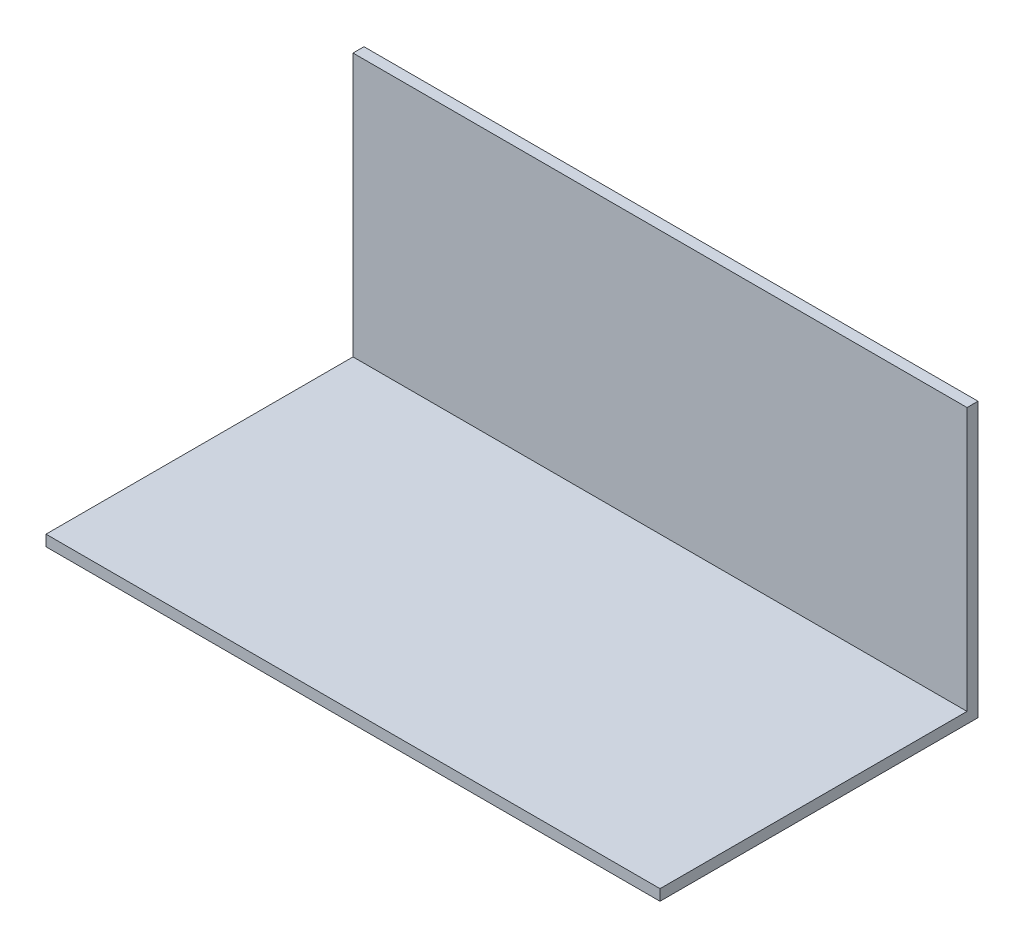
ISO-10303-21;
HEADER;
FILE_DESCRIPTION(('STEP AP214'),'2;1');
FILE_NAME('part.step','',(''),(''),'','','');
FILE_SCHEMA(('AUTOMOTIVE_DESIGN { 1 0 10303 214 1 1 1 1 }'));
ENDSEC;
DATA;
#1=APPLICATION_CONTEXT('core data for automotive mechanical design processes');
#2=APPLICATION_PROTOCOL_DEFINITION('international standard','automotive_design',2000,#1);
#3=PRODUCT_CONTEXT('',#1,'mechanical');
#4=PRODUCT('Part','Part','',(#3));
#5=PRODUCT_RELATED_PRODUCT_CATEGORY('part','',(#4));
#6=PRODUCT_DEFINITION_FORMATION('','',#4);
#7=PRODUCT_DEFINITION_CONTEXT('part definition',#1,'design');
#8=PRODUCT_DEFINITION('design','',#6,#7);
#9=PRODUCT_DEFINITION_SHAPE('','',#8);
#10=(LENGTH_UNIT() NAMED_UNIT(*) SI_UNIT(.MILLI.,.METRE.));
#11=(NAMED_UNIT(*) PLANE_ANGLE_UNIT() SI_UNIT($,.RADIAN.));
#12=(NAMED_UNIT(*) SI_UNIT($,.STERADIAN.) SOLID_ANGLE_UNIT());
#13=UNCERTAINTY_MEASURE_WITH_UNIT(LENGTH_MEASURE(1.E-05),#10,'distance_accuracy_value','');
#14=(GEOMETRIC_REPRESENTATION_CONTEXT(3) GLOBAL_UNCERTAINTY_ASSIGNED_CONTEXT((#13)) GLOBAL_UNIT_ASSIGNED_CONTEXT((#10,
#11,#12)) REPRESENTATION_CONTEXT('',''));
#15=CARTESIAN_POINT('',(0.,0.,0.));
#16=DIRECTION('',(0.,0.,1.));
#17=DIRECTION('',(1.,0.,0.));
#18=AXIS2_PLACEMENT_3D('',#15,#16,#17);
#19=CARTESIAN_POINT('',(0.,6.35,0.));
#20=DIRECTION('',(0.,-1.,0.));
#21=DIRECTION('',(0.,0.,-1.));
#22=AXIS2_PLACEMENT_3D('',#19,#20,#21);
#23=PLANE('',#22);
#24=DIRECTION('',(1.,0.,0.));
#25=VECTOR('',#24,1.);
#26=CARTESIAN_POINT('',(0.,6.35,-177.8));
#27=LINE('',#26,#25);
#28=CARTESIAN_POINT('',(0.,6.35,-177.8));
#29=VERTEX_POINT('',#28);
#30=CARTESIAN_POINT('',(355.6,6.35,-177.8));
#31=VERTEX_POINT('',#30);
#32=EDGE_CURVE('E50',#29,#31,#27,.T.);
#33=ORIENTED_EDGE('',*,*,#32,.F.);
#34=DIRECTION('',(0.,0.,1.));
#35=VECTOR('',#34,1.);
#36=CARTESIAN_POINT('',(0.,6.35,0.));
#37=LINE('',#36,#35);
#38=CARTESIAN_POINT('',(0.,6.35,0.));
#39=VERTEX_POINT('',#38);
#40=EDGE_CURVE('E87',#29,#39,#37,.T.);
#41=ORIENTED_EDGE('',*,*,#40,.T.);
#42=DIRECTION('',(1.,0.,0.));
#43=VECTOR('',#42,1.);
#44=CARTESIAN_POINT('',(0.,6.35,0.));
#45=LINE('',#44,#43);
#46=CARTESIAN_POINT('',(355.6,6.35,0.));
#47=VERTEX_POINT('',#46);
#48=EDGE_CURVE('E56',#39,#47,#45,.T.);
#49=ORIENTED_EDGE('',*,*,#48,.T.);
#50=DIRECTION('',(0.,0.,-1.));
#51=VECTOR('',#50,1.);
#52=CARTESIAN_POINT('',(355.6,6.35,0.));
#53=LINE('',#52,#51);
#54=EDGE_CURVE('E98',#47,#31,#53,.T.);
#55=ORIENTED_EDGE('',*,*,#54,.T.);
#56=EDGE_LOOP('',(#33,#41,#49,#55));
#57=FACE_BOUND('',#56,.T.);
#58=ADVANCED_FACE('F33',(#57),#23,.F.);
#59=CARTESIAN_POINT('',(0.,6.35,0.));
#60=DIRECTION('',(1.,0.,0.));
#61=DIRECTION('',(0.,0.,-1.));
#62=AXIS2_PLACEMENT_3D('',#59,#60,#61);
#63=PLANE('',#62);
#64=DIRECTION('',(0.,0.,1.));
#65=VECTOR('',#64,1.);
#66=CARTESIAN_POINT('',(0.,0.,0.));
#67=LINE('',#66,#65);
#68=CARTESIAN_POINT('',(0.,0.,-184.15));
#69=VERTEX_POINT('',#68);
#70=CARTESIAN_POINT('',(0.,0.,0.));
#71=VERTEX_POINT('',#70);
#72=EDGE_CURVE('E94',#69,#71,#67,.T.);
#73=ORIENTED_EDGE('',*,*,#72,.T.);
#74=DIRECTION('',(0.,-1.,0.));
#75=VECTOR('',#74,1.);
#76=CARTESIAN_POINT('',(0.,6.35,0.));
#77=LINE('',#76,#75);
#78=EDGE_CURVE('E11',#39,#71,#77,.T.);
#79=ORIENTED_EDGE('',*,*,#78,.F.);
#80=ORIENTED_EDGE('',*,*,#40,.F.);
#81=DIRECTION('',(0.,-1.,0.));
#82=VECTOR('',#81,1.);
#83=CARTESIAN_POINT('',(0.,158.75,-177.8));
#84=LINE('',#83,#82);
#85=CARTESIAN_POINT('',(0.,158.75,-177.8));
#86=VERTEX_POINT('',#85);
#87=EDGE_CURVE('E102',#86,#29,#84,.T.);
#88=ORIENTED_EDGE('',*,*,#87,.F.);
#89=DIRECTION('',(0.,0.,1.));
#90=VECTOR('',#89,1.);
#91=CARTESIAN_POINT('',(0.,158.75,-177.8));
#92=LINE('',#91,#90);
#93=CARTESIAN_POINT('',(0.,158.75,-184.15));
#94=VERTEX_POINT('',#93);
#95=EDGE_CURVE('E97',#94,#86,#92,.T.);
#96=ORIENTED_EDGE('',*,*,#95,.F.);
#97=DIRECTION('',(0.,-1.,0.));
#98=VECTOR('',#97,1.);
#99=CARTESIAN_POINT('',(0.,6.35,-184.15));
#100=LINE('',#99,#98);
#101=EDGE_CURVE('E80',#94,#69,#100,.T.);
#102=ORIENTED_EDGE('',*,*,#101,.T.);
#103=EDGE_LOOP('',(#73,#79,#80,#88,#96,#102));
#104=FACE_BOUND('',#103,.T.);
#105=ADVANCED_FACE('F35',(#104),#63,.F.);
#106=CARTESIAN_POINT('',(0.,6.35,0.));
#107=DIRECTION('',(0.,0.,-1.));
#108=DIRECTION('',(-1.,0.,0.));
#109=AXIS2_PLACEMENT_3D('',#106,#107,#108);
#110=PLANE('',#109);
#111=DIRECTION('',(1.,0.,0.));
#112=VECTOR('',#111,1.);
#113=CARTESIAN_POINT('',(0.,0.,0.));
#114=LINE('',#113,#112);
#115=CARTESIAN_POINT('',(355.6,0.,0.));
#116=VERTEX_POINT('',#115);
#117=EDGE_CURVE('E101',#71,#116,#114,.T.);
#118=ORIENTED_EDGE('',*,*,#117,.T.);
#119=DIRECTION('',(0.,-1.,0.));
#120=VECTOR('',#119,1.);
#121=CARTESIAN_POINT('',(355.6,6.35,0.));
#122=LINE('',#121,#120);
#123=EDGE_CURVE('E42',#47,#116,#122,.T.);
#124=ORIENTED_EDGE('',*,*,#123,.F.);
#125=ORIENTED_EDGE('',*,*,#48,.F.);
#126=ORIENTED_EDGE('',*,*,#78,.T.);
#127=EDGE_LOOP('',(#118,#124,#125,#126));
#128=FACE_BOUND('',#127,.T.);
#129=ADVANCED_FACE('F149',(#128),#110,.F.);
#130=CARTESIAN_POINT('',(355.6,6.35,0.));
#131=DIRECTION('',(-1.,0.,0.));
#132=DIRECTION('',(0.,0.,1.));
#133=AXIS2_PLACEMENT_3D('',#130,#131,#132);
#134=PLANE('',#133);
#135=DIRECTION('',(0.,0.,-1.));
#136=VECTOR('',#135,1.);
#137=CARTESIAN_POINT('',(355.6,0.,0.));
#138=LINE('',#137,#136);
#139=CARTESIAN_POINT('',(355.6,0.,-184.15));
#140=VERTEX_POINT('',#139);
#141=EDGE_CURVE('E88',#116,#140,#138,.T.);
#142=ORIENTED_EDGE('',*,*,#141,.T.);
#143=DIRECTION('',(0.,-1.,0.));
#144=VECTOR('',#143,1.);
#145=CARTESIAN_POINT('',(355.6,6.35,-184.15));
#146=LINE('',#145,#144);
#147=CARTESIAN_POINT('',(355.6,158.75,-184.15));
#148=VERTEX_POINT('',#147);
#149=EDGE_CURVE('E83',#148,#140,#146,.T.);
#150=ORIENTED_EDGE('',*,*,#149,.F.);
#151=DIRECTION('',(0.,0.,-1.));
#152=VECTOR('',#151,1.);
#153=CARTESIAN_POINT('',(355.6,158.75,-177.8));
#154=LINE('',#153,#152);
#155=CARTESIAN_POINT('',(355.6,158.75,-177.8));
#156=VERTEX_POINT('',#155);
#157=EDGE_CURVE('E135',#156,#148,#154,.T.);
#158=ORIENTED_EDGE('',*,*,#157,.F.);
#159=DIRECTION('',(0.,-1.,0.));
#160=VECTOR('',#159,1.);
#161=CARTESIAN_POINT('',(355.6,158.75,-177.8));
#162=LINE('',#161,#160);
#163=EDGE_CURVE('E106',#156,#31,#162,.T.);
#164=ORIENTED_EDGE('',*,*,#163,.T.);
#165=ORIENTED_EDGE('',*,*,#54,.F.);
#166=ORIENTED_EDGE('',*,*,#123,.T.);
#167=EDGE_LOOP('',(#142,#150,#158,#164,#165,#166));
#168=FACE_BOUND('',#167,.T.);
#169=ADVANCED_FACE('F133',(#168),#134,.F.);
#170=CARTESIAN_POINT('',(0.,6.35,-184.15));
#171=DIRECTION('',(0.,0.,1.));
#172=DIRECTION('',(1.,0.,0.));
#173=AXIS2_PLACEMENT_3D('',#170,#171,#172);
#174=PLANE('',#173);
#175=DIRECTION('',(-1.,0.,0.));
#176=VECTOR('',#175,1.);
#177=CARTESIAN_POINT('',(0.,0.,-184.15));
#178=LINE('',#177,#176);
#179=EDGE_CURVE('E76',#140,#69,#178,.T.);
#180=ORIENTED_EDGE('',*,*,#179,.T.);
#181=ORIENTED_EDGE('',*,*,#101,.F.);
#182=DIRECTION('',(-1.,0.,0.));
#183=VECTOR('',#182,1.);
#184=CARTESIAN_POINT('',(0.,158.75,-184.15));
#185=LINE('',#184,#183);
#186=EDGE_CURVE('E136',#148,#94,#185,.T.);
#187=ORIENTED_EDGE('',*,*,#186,.F.);
#188=ORIENTED_EDGE('',*,*,#149,.T.);
#189=EDGE_LOOP('',(#180,#181,#187,#188));
#190=FACE_BOUND('',#189,.T.);
#191=ADVANCED_FACE('F78',(#190),#174,.F.);
#192=CARTESIAN_POINT('',(0.,0.,0.));
#193=DIRECTION('',(0.,-1.,0.));
#194=DIRECTION('',(0.,0.,-1.));
#195=AXIS2_PLACEMENT_3D('',#192,#193,#194);
#196=PLANE('',#195);
#197=ORIENTED_EDGE('',*,*,#72,.F.);
#198=ORIENTED_EDGE('',*,*,#179,.F.);
#199=ORIENTED_EDGE('',*,*,#141,.F.);
#200=ORIENTED_EDGE('',*,*,#117,.F.);
#201=EDGE_LOOP('',(#197,#198,#199,#200));
#202=FACE_BOUND('',#201,.T.);
#203=ADVANCED_FACE('F100',(#202),#196,.T.);
#204=CARTESIAN_POINT('',(0.,158.75,-177.8));
#205=DIRECTION('',(0.,0.,-1.));
#206=DIRECTION('',(-1.,0.,0.));
#207=AXIS2_PLACEMENT_3D('',#204,#205,#206);
#208=PLANE('',#207);
#209=ORIENTED_EDGE('',*,*,#32,.T.);
#210=ORIENTED_EDGE('',*,*,#163,.F.);
#211=DIRECTION('',(1.,0.,0.));
#212=VECTOR('',#211,1.);
#213=CARTESIAN_POINT('',(0.,158.75,-177.8));
#214=LINE('',#213,#212);
#215=EDGE_CURVE('E141',#86,#156,#214,.T.);
#216=ORIENTED_EDGE('',*,*,#215,.F.);
#217=ORIENTED_EDGE('',*,*,#87,.T.);
#218=EDGE_LOOP('',(#209,#210,#216,#217));
#219=FACE_BOUND('',#218,.T.);
#220=ADVANCED_FACE('F129',(#219),#208,.F.);
#221=CARTESIAN_POINT('',(0.,158.75,0.));
#222=DIRECTION('',(0.,-1.,0.));
#223=DIRECTION('',(0.,0.,-1.));
#224=AXIS2_PLACEMENT_3D('',#221,#222,#223);
#225=PLANE('',#224);
#226=ORIENTED_EDGE('',*,*,#95,.T.);
#227=ORIENTED_EDGE('',*,*,#215,.T.);
#228=ORIENTED_EDGE('',*,*,#157,.T.);
#229=ORIENTED_EDGE('',*,*,#186,.T.);
#230=EDGE_LOOP('',(#226,#227,#228,#229));
#231=FACE_BOUND('',#230,.T.);
#232=ADVANCED_FACE('F146',(#231),#225,.F.);
#233=CLOSED_SHELL('',(#58,#105,#129,#169,#191,#203,#220,#232));
#234=MANIFOLD_SOLID_BREP('B2',#233);
#235=ADVANCED_BREP_SHAPE_REPRESENTATION('',(#18,#234),#14);
#236=SHAPE_DEFINITION_REPRESENTATION(#9,#235);
ENDSEC;
END-ISO-10303-21;
